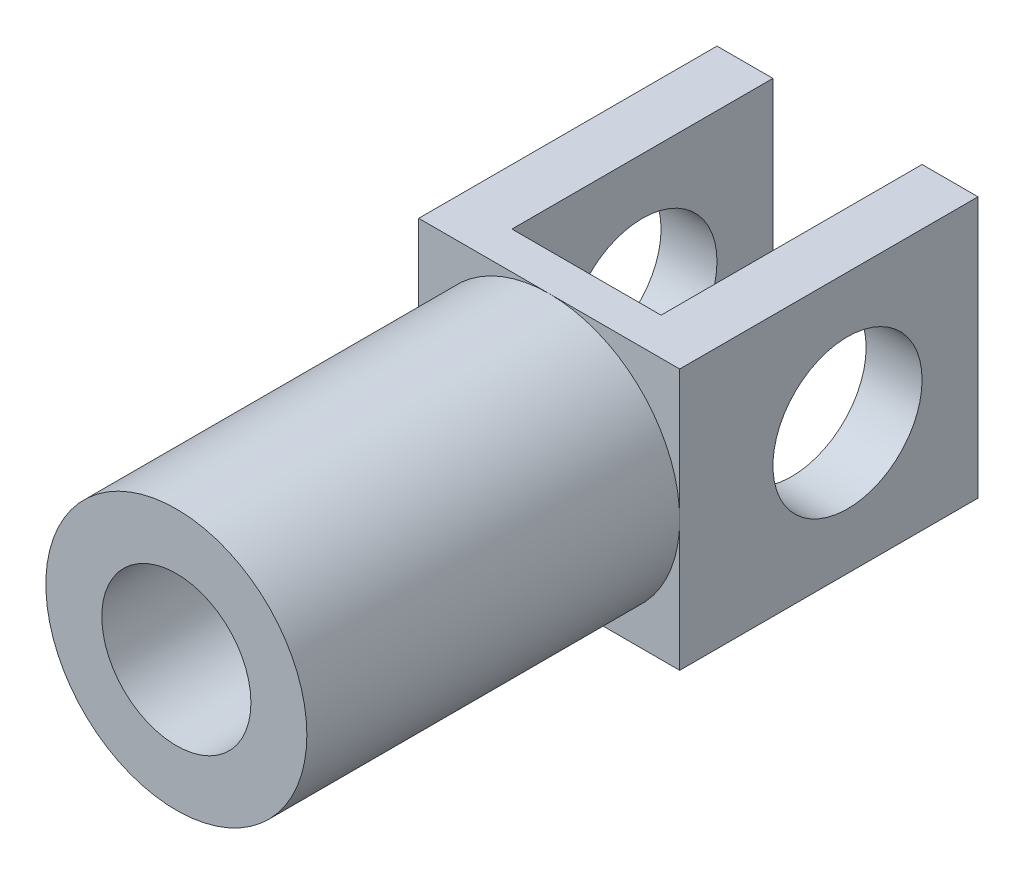
ISO-10303-21;
HEADER;
FILE_DESCRIPTION(('STEP AP214'),'2;1');
FILE_NAME('part.step','',(''),(''),'','','');
FILE_SCHEMA(('AUTOMOTIVE_DESIGN { 1 0 10303 214 1 1 1 1 }'));
ENDSEC;
DATA;
#1=APPLICATION_CONTEXT('core data for automotive mechanical design processes');
#2=APPLICATION_PROTOCOL_DEFINITION('international standard','automotive_design',2000,#1);
#3=PRODUCT_CONTEXT('',#1,'mechanical');
#4=PRODUCT('Part','Part','',(#3));
#5=PRODUCT_RELATED_PRODUCT_CATEGORY('part','',(#4));
#6=PRODUCT_DEFINITION_FORMATION('','',#4);
#7=PRODUCT_DEFINITION_CONTEXT('part definition',#1,'design');
#8=PRODUCT_DEFINITION('design','',#6,#7);
#9=PRODUCT_DEFINITION_SHAPE('','',#8);
#10=(LENGTH_UNIT() NAMED_UNIT(*) SI_UNIT(.MILLI.,.METRE.));
#11=(NAMED_UNIT(*) PLANE_ANGLE_UNIT() SI_UNIT($,.RADIAN.));
#12=(NAMED_UNIT(*) SI_UNIT($,.STERADIAN.) SOLID_ANGLE_UNIT());
#13=UNCERTAINTY_MEASURE_WITH_UNIT(LENGTH_MEASURE(1.E-05),#10,'distance_accuracy_value','');
#14=(GEOMETRIC_REPRESENTATION_CONTEXT(3) GLOBAL_UNCERTAINTY_ASSIGNED_CONTEXT((#13)) GLOBAL_UNIT_ASSIGNED_CONTEXT((#10,
#11,#12)) REPRESENTATION_CONTEXT('',''));
#15=CARTESIAN_POINT('',(0.,0.,0.));
#16=DIRECTION('',(0.,0.,1.));
#17=DIRECTION('',(1.,0.,0.));
#18=AXIS2_PLACEMENT_3D('',#15,#16,#17);
#19=CARTESIAN_POINT('',(0.,0.,-8.));
#20=DIRECTION('',(0.,0.,1.));
#21=DIRECTION('',(1.,0.,0.));
#22=AXIS2_PLACEMENT_3D('',#19,#20,#21);
#23=PLANE('',#22);
#24=DIRECTION('',(-1.,0.,0.));
#25=VECTOR('',#24,1.);
#26=CARTESIAN_POINT('',(-3.5,3.5,-8.));
#27=LINE('',#26,#25);
#28=CARTESIAN_POINT('',(-2.,3.5,-8.));
#29=VERTEX_POINT('',#28);
#30=CARTESIAN_POINT('',(-3.5,3.5,-8.));
#31=VERTEX_POINT('',#30);
#32=EDGE_CURVE('E158',#29,#31,#27,.T.);
#33=ORIENTED_EDGE('',*,*,#32,.F.);
#34=DIRECTION('',(0.,-1.,0.));
#35=VECTOR('',#34,1.);
#36=CARTESIAN_POINT('',(-2.,0.,-8.));
#37=LINE('',#36,#35);
#38=CARTESIAN_POINT('',(-2.,-3.5,-8.));
#39=VERTEX_POINT('',#38);
#40=EDGE_CURVE('E11',#29,#39,#37,.T.);
#41=ORIENTED_EDGE('',*,*,#40,.T.);
#42=DIRECTION('',(1.,0.,0.));
#43=VECTOR('',#42,1.);
#44=CARTESIAN_POINT('',(-3.5,-3.5,-8.));
#45=LINE('',#44,#43);
#46=CARTESIAN_POINT('',(-3.5,-3.5,-8.));
#47=VERTEX_POINT('',#46);
#48=EDGE_CURVE('E152',#47,#39,#45,.T.);
#49=ORIENTED_EDGE('',*,*,#48,.F.);
#50=DIRECTION('',(0.,-1.,0.));
#51=VECTOR('',#50,1.);
#52=CARTESIAN_POINT('',(-3.5,3.5,-8.));
#53=LINE('',#52,#51);
#54=EDGE_CURVE('E147',#31,#47,#53,.T.);
#55=ORIENTED_EDGE('',*,*,#54,.F.);
#56=EDGE_LOOP('',(#33,#41,#49,#55));
#57=FACE_BOUND('',#56,.T.);
#58=ADVANCED_FACE('F37',(#57),#23,.F.);
#59=CARTESIAN_POINT('',(0.,0.,10.));
#60=DIRECTION('',(0.,0.,1.));
#61=DIRECTION('',(1.,0.,0.));
#62=AXIS2_PLACEMENT_3D('',#59,#60,#61);
#63=PLANE('',#62);
#64=CARTESIAN_POINT('',(0.,0.,10.));
#65=DIRECTION('',(0.,0.,1.));
#66=DIRECTION('',(1.,0.,0.));
#67=AXIS2_PLACEMENT_3D('',#64,#65,#66);
#68=CIRCLE('',#67,3.5);
#69=CARTESIAN_POINT('',(3.5,0.,10.));
#70=VERTEX_POINT('',#69);
#71=EDGE_CURVE('E192',#70,#70,#68,.T.);
#72=ORIENTED_EDGE('',*,*,#71,.T.);
#73=EDGE_LOOP('',(#72));
#74=FACE_BOUND('',#73,.T.);
#75=CARTESIAN_POINT('',(0.,0.,10.));
#76=DIRECTION('',(0.,0.,1.));
#77=DIRECTION('',(1.,0.,0.));
#78=AXIS2_PLACEMENT_3D('',#75,#76,#77);
#79=CIRCLE('',#78,2.);
#80=CARTESIAN_POINT('',(2.,0.,10.));
#81=VERTEX_POINT('',#80);
#82=EDGE_CURVE('E186',#81,#81,#79,.T.);
#83=ORIENTED_EDGE('',*,*,#82,.F.);
#84=EDGE_LOOP('',(#83));
#85=FACE_BOUND('',#84,.T.);
#86=ADVANCED_FACE('F229',(#74,#85),#63,.T.);
#87=CARTESIAN_POINT('',(0.,0.,10.));
#88=DIRECTION('',(0.,0.,-1.));
#89=DIRECTION('',(-1.,0.,0.));
#90=AXIS2_PLACEMENT_3D('',#87,#88,#89);
#91=CYLINDRICAL_SURFACE('',#90,3.5);
#92=ORIENTED_EDGE('',*,*,#71,.F.);
#93=EDGE_LOOP('',(#92));
#94=FACE_BOUND('',#93,.T.);
#95=CARTESIAN_POINT('',(0.,0.,0.));
#96=DIRECTION('',(0.,0.,1.));
#97=DIRECTION('',(1.,0.,0.));
#98=AXIS2_PLACEMENT_3D('',#95,#96,#97);
#99=CIRCLE('',#98,3.5);
#100=CARTESIAN_POINT('',(3.5,0.,0.));
#101=VERTEX_POINT('',#100);
#102=CARTESIAN_POINT('',(0.,3.5,0.));
#103=VERTEX_POINT('',#102);
#104=EDGE_CURVE('E195',#101,#103,#99,.T.);
#105=ORIENTED_EDGE('',*,*,#104,.T.);
#106=CARTESIAN_POINT('',(-3.5,0.,0.));
#107=VERTEX_POINT('',#106);
#108=EDGE_CURVE('E198',#103,#107,#99,.T.);
#109=ORIENTED_EDGE('',*,*,#108,.T.);
#110=CARTESIAN_POINT('',(0.,-3.5,0.));
#111=VERTEX_POINT('',#110);
#112=EDGE_CURVE('E400',#107,#111,#99,.T.);
#113=ORIENTED_EDGE('',*,*,#112,.T.);
#114=EDGE_CURVE('E189',#111,#101,#99,.T.);
#115=ORIENTED_EDGE('',*,*,#114,.T.);
#116=EDGE_LOOP('',(#105,#109,#113,#115));
#117=FACE_BOUND('',#116,.T.);
#118=ADVANCED_FACE('F39',(#94,#117),#91,.T.);
#119=CARTESIAN_POINT('',(0.,0.,10.));
#120=DIRECTION('',(0.,0.,-1.));
#121=DIRECTION('',(-1.,0.,0.));
#122=AXIS2_PLACEMENT_3D('',#119,#120,#121);
#123=CYLINDRICAL_SURFACE('',#122,2.);
#124=ORIENTED_EDGE('',*,*,#82,.T.);
#125=EDGE_LOOP('',(#124));
#126=FACE_BOUND('',#125,.T.);
#127=CARTESIAN_POINT('',(0.,0.,0.));
#128=DIRECTION('',(0.,0.,1.));
#129=DIRECTION('',(1.,0.,0.));
#130=AXIS2_PLACEMENT_3D('',#127,#128,#129);
#131=CIRCLE('',#130,2.);
#132=CARTESIAN_POINT('',(2.,0.,0.));
#133=VERTEX_POINT('',#132);
#134=EDGE_CURVE('E177',#133,#133,#131,.T.);
#135=ORIENTED_EDGE('',*,*,#134,.F.);
#136=EDGE_LOOP('',(#135));
#137=FACE_BOUND('',#136,.T.);
#138=ADVANCED_FACE('F254',(#126,#137),#123,.F.);
#139=CARTESIAN_POINT('',(0.,0.,0.));
#140=DIRECTION('',(0.,0.,1.));
#141=DIRECTION('',(1.,0.,0.));
#142=AXIS2_PLACEMENT_3D('',#139,#140,#141);
#143=PLANE('',#142);
#144=ORIENTED_EDGE('',*,*,#134,.T.);
#145=EDGE_LOOP('',(#144));
#146=FACE_BOUND('',#145,.T.);
#147=ADVANCED_FACE('F256',(#146),#143,.T.);
#148=ORIENTED_EDGE('',*,*,#104,.F.);
#149=DIRECTION('',(0.,1.,0.));
#150=VECTOR('',#149,1.);
#151=CARTESIAN_POINT('',(3.5,3.5,0.));
#152=LINE('',#151,#150);
#153=CARTESIAN_POINT('',(3.5,3.5,0.));
#154=VERTEX_POINT('',#153);
#155=EDGE_CURVE('E169',#101,#154,#152,.T.);
#156=ORIENTED_EDGE('',*,*,#155,.T.);
#157=DIRECTION('',(-1.,0.,0.));
#158=VECTOR('',#157,1.);
#159=CARTESIAN_POINT('',(-3.5,3.5,0.));
#160=LINE('',#159,#158);
#161=EDGE_CURVE('E151',#154,#103,#160,.T.);
#162=ORIENTED_EDGE('',*,*,#161,.T.);
#163=EDGE_LOOP('',(#148,#156,#162));
#164=FACE_BOUND('',#163,.T.);
#165=ADVANCED_FACE('F262',(#164),#143,.T.);
#166=ORIENTED_EDGE('',*,*,#108,.F.);
#167=CARTESIAN_POINT('',(-3.5,3.5,0.));
#168=VERTEX_POINT('',#167);
#169=EDGE_CURVE('E171',#103,#168,#160,.T.);
#170=ORIENTED_EDGE('',*,*,#169,.T.);
#171=DIRECTION('',(0.,-1.,0.));
#172=VECTOR('',#171,1.);
#173=CARTESIAN_POINT('',(-3.5,3.5,0.));
#174=LINE('',#173,#172);
#175=EDGE_CURVE('E162',#168,#107,#174,.T.);
#176=ORIENTED_EDGE('',*,*,#175,.T.);
#177=EDGE_LOOP('',(#166,#170,#176));
#178=FACE_BOUND('',#177,.T.);
#179=ADVANCED_FACE('F279',(#178),#143,.T.);
#180=ORIENTED_EDGE('',*,*,#112,.F.);
#181=CARTESIAN_POINT('',(-3.5,-3.5,0.));
#182=VERTEX_POINT('',#181);
#183=EDGE_CURVE('E145',#107,#182,#174,.T.);
#184=ORIENTED_EDGE('',*,*,#183,.T.);
#185=DIRECTION('',(1.,0.,0.));
#186=VECTOR('',#185,1.);
#187=CARTESIAN_POINT('',(-3.5,-3.5,0.));
#188=LINE('',#187,#186);
#189=EDGE_CURVE('E166',#182,#111,#188,.T.);
#190=ORIENTED_EDGE('',*,*,#189,.T.);
#191=EDGE_LOOP('',(#180,#184,#190));
#192=FACE_BOUND('',#191,.T.);
#193=ADVANCED_FACE('F283',(#192),#143,.T.);
#194=ORIENTED_EDGE('',*,*,#114,.F.);
#195=CARTESIAN_POINT('',(3.5,-3.5,0.));
#196=VERTEX_POINT('',#195);
#197=EDGE_CURVE('E165',#111,#196,#188,.T.);
#198=ORIENTED_EDGE('',*,*,#197,.T.);
#199=EDGE_CURVE('E61',#196,#101,#152,.T.);
#200=ORIENTED_EDGE('',*,*,#199,.T.);
#201=EDGE_LOOP('',(#194,#198,#200));
#202=FACE_BOUND('',#201,.T.);
#203=ADVANCED_FACE('F252',(#202),#143,.T.);
#204=CARTESIAN_POINT('',(-3.5,3.5,-8.));
#205=DIRECTION('',(-1.,0.,0.));
#206=DIRECTION('',(0.,-1.,0.));
#207=AXIS2_PLACEMENT_3D('',#204,#205,#206);
#208=PLANE('',#207);
#209=CARTESIAN_POINT('',(-3.5,0.,-4.5));
#210=DIRECTION('',(1.,0.,0.));
#211=DIRECTION('',(0.,0.,-1.));
#212=AXIS2_PLACEMENT_3D('',#209,#210,#211);
#213=CIRCLE('',#212,2.);
#214=CARTESIAN_POINT('',(-3.5,0.,-6.5));
#215=VERTEX_POINT('',#214);
#216=EDGE_CURVE('E413',#215,#215,#213,.T.);
#217=ORIENTED_EDGE('',*,*,#216,.T.);
#218=EDGE_LOOP('',(#217));
#219=FACE_BOUND('',#218,.T.);
#220=ORIENTED_EDGE('',*,*,#175,.F.);
#221=DIRECTION('',(0.,0.,1.));
#222=VECTOR('',#221,1.);
#223=CARTESIAN_POINT('',(-3.5,3.5,-8.));
#224=LINE('',#223,#222);
#225=EDGE_CURVE('E174',#31,#168,#224,.T.);
#226=ORIENTED_EDGE('',*,*,#225,.F.);
#227=ORIENTED_EDGE('',*,*,#54,.T.);
#228=DIRECTION('',(0.,0.,1.));
#229=VECTOR('',#228,1.);
#230=CARTESIAN_POINT('',(-3.5,-3.5,-8.));
#231=LINE('',#230,#229);
#232=EDGE_CURVE('E161',#47,#182,#231,.T.);
#233=ORIENTED_EDGE('',*,*,#232,.T.);
#234=ORIENTED_EDGE('',*,*,#183,.F.);
#235=EDGE_LOOP('',(#220,#226,#227,#233,#234));
#236=FACE_BOUND('',#235,.T.);
#237=ADVANCED_FACE('F249',(#219,#236),#208,.T.);
#238=CARTESIAN_POINT('',(-3.5,3.5,-8.));
#239=DIRECTION('',(0.,1.,0.));
#240=DIRECTION('',(0.,0.,1.));
#241=AXIS2_PLACEMENT_3D('',#238,#239,#240);
#242=PLANE('',#241);
#243=DIRECTION('',(0.,0.,1.));
#244=VECTOR('',#243,1.);
#245=CARTESIAN_POINT('',(-2.,3.5,-11.));
#246=LINE('',#245,#244);
#247=CARTESIAN_POINT('',(-2.,3.5,-1.));
#248=VERTEX_POINT('',#247);
#249=EDGE_CURVE('E114',#29,#248,#246,.T.);
#250=ORIENTED_EDGE('',*,*,#249,.F.);
#251=ORIENTED_EDGE('',*,*,#32,.T.);
#252=ORIENTED_EDGE('',*,*,#225,.T.);
#253=ORIENTED_EDGE('',*,*,#169,.F.);
#254=ORIENTED_EDGE('',*,*,#161,.F.);
#255=DIRECTION('',(0.,0.,1.));
#256=VECTOR('',#255,1.);
#257=CARTESIAN_POINT('',(3.5,3.5,-8.));
#258=LINE('',#257,#256);
#259=CARTESIAN_POINT('',(3.5,3.5,-8.));
#260=VERTEX_POINT('',#259);
#261=EDGE_CURVE('E178',#260,#154,#258,.T.);
#262=ORIENTED_EDGE('',*,*,#261,.F.);
#263=CARTESIAN_POINT('',(2.,3.5,-8.));
#264=VERTEX_POINT('',#263);
#265=EDGE_CURVE('E159',#260,#264,#27,.T.);
#266=ORIENTED_EDGE('',*,*,#265,.T.);
#267=DIRECTION('',(0.,0.,-1.));
#268=VECTOR('',#267,1.);
#269=CARTESIAN_POINT('',(2.,3.5,-11.));
#270=LINE('',#269,#268);
#271=CARTESIAN_POINT('',(2.,3.5,-1.));
#272=VERTEX_POINT('',#271);
#273=EDGE_CURVE('E53',#272,#264,#270,.T.);
#274=ORIENTED_EDGE('',*,*,#273,.F.);
#275=DIRECTION('',(1.,0.,0.));
#276=VECTOR('',#275,1.);
#277=CARTESIAN_POINT('',(-2.,3.5,-1.));
#278=LINE('',#277,#276);
#279=EDGE_CURVE('E122',#248,#272,#278,.T.);
#280=ORIENTED_EDGE('',*,*,#279,.F.);
#281=EDGE_LOOP('',(#250,#251,#252,#253,#254,#262,#266,#274,#280));
#282=FACE_BOUND('',#281,.T.);
#283=ADVANCED_FACE('F134',(#282),#242,.T.);
#284=CARTESIAN_POINT('',(3.5,3.5,-8.));
#285=DIRECTION('',(1.,0.,0.));
#286=DIRECTION('',(0.,1.,0.));
#287=AXIS2_PLACEMENT_3D('',#284,#285,#286);
#288=PLANE('',#287);
#289=CARTESIAN_POINT('',(3.5,0.,-4.5));
#290=DIRECTION('',(1.,0.,0.));
#291=DIRECTION('',(0.,0.,-1.));
#292=AXIS2_PLACEMENT_3D('',#289,#290,#291);
#293=CIRCLE('',#292,2.);
#294=CARTESIAN_POINT('',(3.5,0.,-6.5));
#295=VERTEX_POINT('',#294);
#296=EDGE_CURVE('E418',#295,#295,#293,.T.);
#297=ORIENTED_EDGE('',*,*,#296,.F.);
#298=EDGE_LOOP('',(#297));
#299=FACE_BOUND('',#298,.T.);
#300=ORIENTED_EDGE('',*,*,#199,.F.);
#301=DIRECTION('',(0.,0.,1.));
#302=VECTOR('',#301,1.);
#303=CARTESIAN_POINT('',(3.5,-3.5,-8.));
#304=LINE('',#303,#302);
#305=CARTESIAN_POINT('',(3.5,-3.5,-8.));
#306=VERTEX_POINT('',#305);
#307=EDGE_CURVE('E181',#306,#196,#304,.T.);
#308=ORIENTED_EDGE('',*,*,#307,.F.);
#309=DIRECTION('',(0.,1.,0.));
#310=VECTOR('',#309,1.);
#311=CARTESIAN_POINT('',(3.5,3.5,-8.));
#312=LINE('',#311,#310);
#313=EDGE_CURVE('E155',#306,#260,#312,.T.);
#314=ORIENTED_EDGE('',*,*,#313,.T.);
#315=ORIENTED_EDGE('',*,*,#261,.T.);
#316=ORIENTED_EDGE('',*,*,#155,.F.);
#317=EDGE_LOOP('',(#300,#308,#314,#315,#316));
#318=FACE_BOUND('',#317,.T.);
#319=ADVANCED_FACE('F209',(#299,#318),#288,.T.);
#320=CARTESIAN_POINT('',(-3.5,-3.5,-8.));
#321=DIRECTION('',(0.,-1.,0.));
#322=DIRECTION('',(0.,0.,-1.));
#323=AXIS2_PLACEMENT_3D('',#320,#321,#322);
#324=PLANE('',#323);
#325=DIRECTION('',(0.,0.,1.));
#326=VECTOR('',#325,1.);
#327=CARTESIAN_POINT('',(-2.,-3.5,-11.));
#328=LINE('',#327,#326);
#329=CARTESIAN_POINT('',(-2.,-3.5,-1.));
#330=VERTEX_POINT('',#329);
#331=EDGE_CURVE('E137',#39,#330,#328,.T.);
#332=ORIENTED_EDGE('',*,*,#331,.T.);
#333=DIRECTION('',(1.,0.,0.));
#334=VECTOR('',#333,1.);
#335=CARTESIAN_POINT('',(-2.,-3.5,-1.));
#336=LINE('',#335,#334);
#337=CARTESIAN_POINT('',(2.,-3.5,-1.));
#338=VERTEX_POINT('',#337);
#339=EDGE_CURVE('E129',#330,#338,#336,.T.);
#340=ORIENTED_EDGE('',*,*,#339,.T.);
#341=DIRECTION('',(0.,0.,-1.));
#342=VECTOR('',#341,1.);
#343=CARTESIAN_POINT('',(2.,-3.5,-11.));
#344=LINE('',#343,#342);
#345=CARTESIAN_POINT('',(2.,-3.5,-8.));
#346=VERTEX_POINT('',#345);
#347=EDGE_CURVE('E132',#338,#346,#344,.T.);
#348=ORIENTED_EDGE('',*,*,#347,.T.);
#349=EDGE_CURVE('E150',#346,#306,#45,.T.);
#350=ORIENTED_EDGE('',*,*,#349,.T.);
#351=ORIENTED_EDGE('',*,*,#307,.T.);
#352=ORIENTED_EDGE('',*,*,#197,.F.);
#353=ORIENTED_EDGE('',*,*,#189,.F.);
#354=ORIENTED_EDGE('',*,*,#232,.F.);
#355=ORIENTED_EDGE('',*,*,#48,.T.);
#356=EDGE_LOOP('',(#332,#340,#348,#350,#351,#352,#353,#354,#355));
#357=FACE_BOUND('',#356,.T.);
#358=ADVANCED_FACE('F212',(#357),#324,.T.);
#359=ORIENTED_EDGE('',*,*,#349,.F.);
#360=DIRECTION('',(0.,1.,0.));
#361=VECTOR('',#360,1.);
#362=CARTESIAN_POINT('',(2.,0.,-8.));
#363=LINE('',#362,#361);
#364=EDGE_CURVE('E46',#346,#264,#363,.T.);
#365=ORIENTED_EDGE('',*,*,#364,.T.);
#366=ORIENTED_EDGE('',*,*,#265,.F.);
#367=ORIENTED_EDGE('',*,*,#313,.F.);
#368=EDGE_LOOP('',(#359,#365,#366,#367));
#369=FACE_BOUND('',#368,.T.);
#370=ADVANCED_FACE('F202',(#369),#23,.F.);
#371=CARTESIAN_POINT('',(-2.,-3.5,-11.));
#372=DIRECTION('',(-1.,0.,0.));
#373=DIRECTION('',(0.,0.,1.));
#374=AXIS2_PLACEMENT_3D('',#371,#372,#373);
#375=PLANE('',#374);
#376=CARTESIAN_POINT('',(-2.,0.,-4.5));
#377=DIRECTION('',(-1.,0.,0.));
#378=DIRECTION('',(0.,0.,1.));
#379=AXIS2_PLACEMENT_3D('',#376,#377,#378);
#380=CIRCLE('',#379,2.);
#381=CARTESIAN_POINT('',(-2.,0.,-2.5));
#382=VERTEX_POINT('',#381);
#383=EDGE_CURVE('E123',#382,#382,#380,.T.);
#384=ORIENTED_EDGE('',*,*,#383,.T.);
#385=EDGE_LOOP('',(#384));
#386=FACE_BOUND('',#385,.T.);
#387=ORIENTED_EDGE('',*,*,#249,.T.);
#388=DIRECTION('',(0.,1.,0.));
#389=VECTOR('',#388,1.);
#390=CARTESIAN_POINT('',(-2.,-3.5,-1.));
#391=LINE('',#390,#389);
#392=EDGE_CURVE('E117',#330,#248,#391,.T.);
#393=ORIENTED_EDGE('',*,*,#392,.F.);
#394=ORIENTED_EDGE('',*,*,#331,.F.);
#395=ORIENTED_EDGE('',*,*,#40,.F.);
#396=EDGE_LOOP('',(#387,#393,#394,#395));
#397=FACE_BOUND('',#396,.T.);
#398=ADVANCED_FACE('F116',(#386,#397),#375,.F.);
#399=CARTESIAN_POINT('',(2.,-3.5,-11.));
#400=DIRECTION('',(1.,0.,0.));
#401=DIRECTION('',(0.,0.,-1.));
#402=AXIS2_PLACEMENT_3D('',#399,#400,#401);
#403=PLANE('',#402);
#404=CARTESIAN_POINT('',(2.,0.,-4.5));
#405=DIRECTION('',(1.,0.,0.));
#406=DIRECTION('',(0.,0.,-1.));
#407=AXIS2_PLACEMENT_3D('',#404,#405,#406);
#408=CIRCLE('',#407,2.);
#409=CARTESIAN_POINT('',(2.,0.,-6.5));
#410=VERTEX_POINT('',#409);
#411=EDGE_CURVE('E41',#410,#410,#408,.T.);
#412=ORIENTED_EDGE('',*,*,#411,.T.);
#413=EDGE_LOOP('',(#412));
#414=FACE_BOUND('',#413,.T.);
#415=ORIENTED_EDGE('',*,*,#347,.F.);
#416=DIRECTION('',(0.,1.,0.));
#417=VECTOR('',#416,1.);
#418=CARTESIAN_POINT('',(2.,-3.5,-1.));
#419=LINE('',#418,#417);
#420=EDGE_CURVE('E131',#338,#272,#419,.T.);
#421=ORIENTED_EDGE('',*,*,#420,.T.);
#422=ORIENTED_EDGE('',*,*,#273,.T.);
#423=ORIENTED_EDGE('',*,*,#364,.F.);
#424=EDGE_LOOP('',(#415,#421,#422,#423));
#425=FACE_BOUND('',#424,.T.);
#426=ADVANCED_FACE('F214',(#414,#425),#403,.F.);
#427=CARTESIAN_POINT('',(-2.,-3.5,-1.));
#428=DIRECTION('',(0.,0.,1.));
#429=DIRECTION('',(1.,0.,0.));
#430=AXIS2_PLACEMENT_3D('',#427,#428,#429);
#431=PLANE('',#430);
#432=ORIENTED_EDGE('',*,*,#420,.F.);
#433=ORIENTED_EDGE('',*,*,#339,.F.);
#434=ORIENTED_EDGE('',*,*,#392,.T.);
#435=ORIENTED_EDGE('',*,*,#279,.T.);
#436=EDGE_LOOP('',(#432,#433,#434,#435));
#437=FACE_BOUND('',#436,.T.);
#438=ADVANCED_FACE('F127',(#437),#431,.F.);
#439=CARTESIAN_POINT('',(-3.5,0.,-4.5));
#440=DIRECTION('',(1.,0.,0.));
#441=DIRECTION('',(0.,0.,-1.));
#442=AXIS2_PLACEMENT_3D('',#439,#440,#441);
#443=CYLINDRICAL_SURFACE('',#442,2.);
#444=ORIENTED_EDGE('',*,*,#296,.T.);
#445=EDGE_LOOP('',(#444));
#446=FACE_BOUND('',#445,.T.);
#447=ORIENTED_EDGE('',*,*,#411,.F.);
#448=EDGE_LOOP('',(#447));
#449=FACE_BOUND('',#448,.T.);
#450=ADVANCED_FACE('F222',(#446,#449),#443,.F.);
#451=ORIENTED_EDGE('',*,*,#216,.F.);
#452=EDGE_LOOP('',(#451));
#453=FACE_BOUND('',#452,.T.);
#454=ORIENTED_EDGE('',*,*,#383,.F.);
#455=EDGE_LOOP('',(#454));
#456=FACE_BOUND('',#455,.T.);
#457=ADVANCED_FACE('F326',(#453,#456),#443,.F.);
#458=CLOSED_SHELL('',(#58,#86,#118,#138,#147,#165,#179,#193,#203,#237,#283,#319,#358,#370,#398,
#426,#438,#450,#457));
#459=MANIFOLD_SOLID_BREP('B2',#458);
#460=ADVANCED_BREP_SHAPE_REPRESENTATION('',(#18,#459),#14);
#461=SHAPE_DEFINITION_REPRESENTATION(#9,#460);
ENDSEC;
END-ISO-10303-21;
